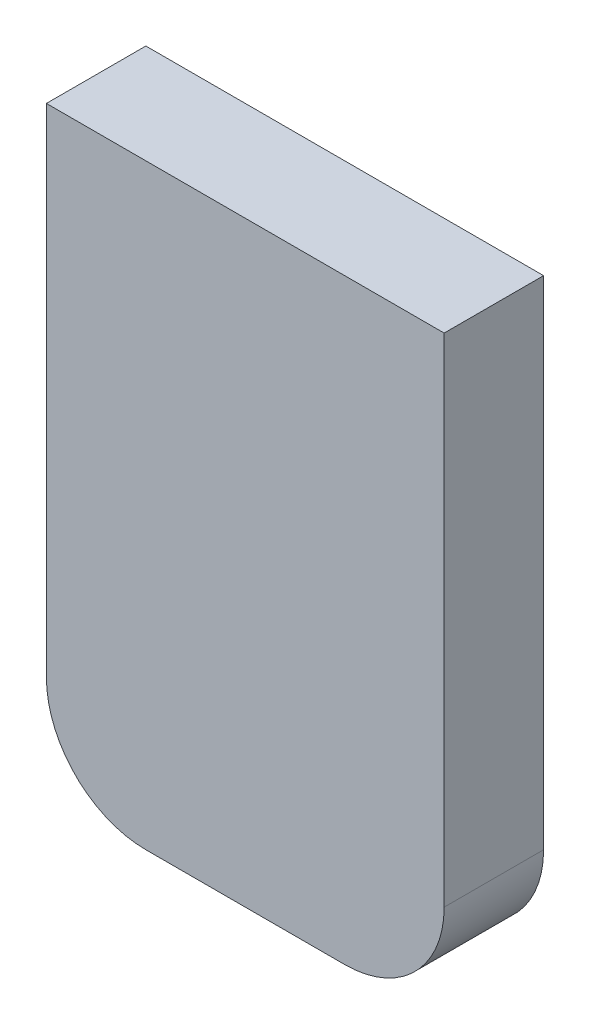
ISO-10303-21;
HEADER;
FILE_DESCRIPTION(('STEP AP214'),'2;1');
FILE_NAME('part.step','',(''),(''),'','','');
FILE_SCHEMA(('AUTOMOTIVE_DESIGN { 1 0 10303 214 1 1 1 1 }'));
ENDSEC;
DATA;
#1=APPLICATION_CONTEXT('core data for automotive mechanical design processes');
#2=APPLICATION_PROTOCOL_DEFINITION('international standard','automotive_design',2000,#1);
#3=PRODUCT_CONTEXT('',#1,'mechanical');
#4=PRODUCT('Part','Part','',(#3));
#5=PRODUCT_RELATED_PRODUCT_CATEGORY('part','',(#4));
#6=PRODUCT_DEFINITION_FORMATION('','',#4);
#7=PRODUCT_DEFINITION_CONTEXT('part definition',#1,'design');
#8=PRODUCT_DEFINITION('design','',#6,#7);
#9=PRODUCT_DEFINITION_SHAPE('','',#8);
#10=(LENGTH_UNIT() NAMED_UNIT(*) SI_UNIT(.MILLI.,.METRE.));
#11=(NAMED_UNIT(*) PLANE_ANGLE_UNIT() SI_UNIT($,.RADIAN.));
#12=(NAMED_UNIT(*) SI_UNIT($,.STERADIAN.) SOLID_ANGLE_UNIT());
#13=UNCERTAINTY_MEASURE_WITH_UNIT(LENGTH_MEASURE(1.E-05),#10,'distance_accuracy_value','');
#14=(GEOMETRIC_REPRESENTATION_CONTEXT(3) GLOBAL_UNCERTAINTY_ASSIGNED_CONTEXT((#13)) GLOBAL_UNIT_ASSIGNED_CONTEXT((#10,
#11,#12)) REPRESENTATION_CONTEXT('',''));
#15=CARTESIAN_POINT('',(0.,0.,0.));
#16=DIRECTION('',(0.,0.,1.));
#17=DIRECTION('',(1.,0.,0.));
#18=AXIS2_PLACEMENT_3D('',#15,#16,#17);
#19=CARTESIAN_POINT('',(-60.6067964513859,-55.8264462809917,0.));
#20=DIRECTION('',(0.,0.,-1.));
#21=DIRECTION('',(-1.,0.,0.));
#22=AXIS2_PLACEMENT_3D('',#19,#20,#21);
#23=CYLINDRICAL_SURFACE('',#22,7.);
#24=DIRECTION('',(0.,0.,-1.));
#25=VECTOR('',#24,1.);
#26=CARTESIAN_POINT('',(-63.8067964513859,-62.0521992475011,0.));
#27=LINE('',#26,#25);
#28=CARTESIAN_POINT('',(-63.8067964513859,-62.0521992475011,40.));
#29=VERTEX_POINT('',#28);
#30=CARTESIAN_POINT('',(-63.8067964513859,-62.0521992475011,47.));
#31=VERTEX_POINT('',#30);
#32=EDGE_CURVE('E48',#29,#31,#27,.F.);
#33=ORIENTED_EDGE('',*,*,#32,.F.);
#34=CARTESIAN_POINT('',(-60.6067964513859,-55.8264462809917,40.));
#35=DIRECTION('',(0.,0.,1.));
#36=DIRECTION('',(1.,0.,0.));
#37=AXIS2_PLACEMENT_3D('',#34,#35,#36);
#38=CIRCLE('',#37,7.);
#39=CARTESIAN_POINT('',(-67.6067964513859,-55.8264462809918,40.));
#40=VERTEX_POINT('',#39);
#41=EDGE_CURVE('E232',#29,#40,#38,.F.);
#42=ORIENTED_EDGE('',*,*,#41,.T.);
#43=DIRECTION('',(0.,0.,1.));
#44=VECTOR('',#43,1.);
#45=CARTESIAN_POINT('',(-67.6067964513859,-55.8264462809918,0.));
#46=LINE('',#45,#44);
#47=CARTESIAN_POINT('',(-67.6067964513859,-55.8264462809918,47.));
#48=VERTEX_POINT('',#47);
#49=EDGE_CURVE('E211',#40,#48,#46,.T.);
#50=ORIENTED_EDGE('',*,*,#49,.T.);
#51=CARTESIAN_POINT('',(-60.6067964513859,-55.8264462809917,47.));
#52=DIRECTION('',(0.,0.,1.));
#53=DIRECTION('',(1.,0.,0.));
#54=AXIS2_PLACEMENT_3D('',#51,#52,#53);
#55=CIRCLE('',#54,7.);
#56=EDGE_CURVE('E208',#48,#31,#55,.T.);
#57=ORIENTED_EDGE('',*,*,#56,.T.);
#58=EDGE_LOOP('',(#33,#42,#50,#57));
#59=FACE_BOUND('',#58,.T.);
#60=ADVANCED_FACE('F33',(#59),#23,.F.);
#61=CARTESIAN_POINT('',(-40.6067964513859,-55.8264462809917,50.));
#62=DIRECTION('',(0.,0.,-1.));
#63=DIRECTION('',(-1.,0.,0.));
#64=AXIS2_PLACEMENT_3D('',#61,#62,#63);
#65=CYLINDRICAL_SURFACE('',#64,7.);
#66=DIRECTION('',(0.,0.,-1.));
#67=VECTOR('',#66,1.);
#68=CARTESIAN_POINT('',(-37.4067964513859,-62.0521992475011,50.));
#69=LINE('',#68,#67);
#70=CARTESIAN_POINT('',(-37.4067964513859,-62.0521992475011,47.));
#71=VERTEX_POINT('',#70);
#72=CARTESIAN_POINT('',(-37.4067964513859,-62.0521992475011,40.));
#73=VERTEX_POINT('',#72);
#74=EDGE_CURVE('E169',#71,#73,#69,.T.);
#75=ORIENTED_EDGE('',*,*,#74,.F.);
#76=CARTESIAN_POINT('',(-40.6067964513859,-55.8264462809917,47.));
#77=DIRECTION('',(0.,0.,1.));
#78=DIRECTION('',(1.,0.,0.));
#79=AXIS2_PLACEMENT_3D('',#76,#77,#78);
#80=CIRCLE('',#79,7.);
#81=CARTESIAN_POINT('',(-33.6067964513859,-55.8264462809917,47.));
#82=VERTEX_POINT('',#81);
#83=EDGE_CURVE('E213',#71,#82,#80,.T.);
#84=ORIENTED_EDGE('',*,*,#83,.T.);
#85=DIRECTION('',(0.,0.,1.));
#86=VECTOR('',#85,1.);
#87=CARTESIAN_POINT('',(-33.6067964513859,-55.8264462809917,50.));
#88=LINE('',#87,#86);
#89=CARTESIAN_POINT('',(-33.6067964513859,-55.8264462809917,40.));
#90=VERTEX_POINT('',#89);
#91=EDGE_CURVE('E223',#82,#90,#88,.F.);
#92=ORIENTED_EDGE('',*,*,#91,.T.);
#93=CARTESIAN_POINT('',(-40.6067964513859,-55.8264462809917,40.));
#94=DIRECTION('',(0.,0.,1.));
#95=DIRECTION('',(1.,0.,0.));
#96=AXIS2_PLACEMENT_3D('',#93,#94,#95);
#97=CIRCLE('',#96,7.);
#98=EDGE_CURVE('E56',#90,#73,#97,.F.);
#99=ORIENTED_EDGE('',*,*,#98,.T.);
#100=EDGE_LOOP('',(#75,#84,#92,#99));
#101=FACE_BOUND('',#100,.T.);
#102=ADVANCED_FACE('F297',(#101),#65,.F.);
#103=CARTESIAN_POINT('',(-80.6067964513859,44.1735537190083,47.));
#104=DIRECTION('',(0.,0.,1.));
#105=DIRECTION('',(1.,0.,0.));
#106=AXIS2_PLACEMENT_3D('',#103,#104,#105);
#107=PLANE('',#106);
#108=DIRECTION('',(0.,1.,0.));
#109=VECTOR('',#108,1.);
#110=CARTESIAN_POINT('',(-63.8067964513859,-64.0264462809917,47.));
#111=LINE('',#110,#109);
#112=CARTESIAN_POINT('',(-63.8067964513859,-8.82644628099174,47.));
#113=VERTEX_POINT('',#112);
#114=EDGE_CURVE('E200',#31,#113,#111,.T.);
#115=ORIENTED_EDGE('',*,*,#114,.F.);
#116=ORIENTED_EDGE('',*,*,#56,.F.);
#117=DIRECTION('',(0.,-1.,0.));
#118=VECTOR('',#117,1.);
#119=CARTESIAN_POINT('',(-67.6067964513859,44.1735537190083,47.));
#120=LINE('',#119,#118);
#121=CARTESIAN_POINT('',(-67.6067964513859,-8.82644628099174,47.));
#122=VERTEX_POINT('',#121);
#123=EDGE_CURVE('E217',#122,#48,#120,.T.);
#124=ORIENTED_EDGE('',*,*,#123,.F.);
#125=DIRECTION('',(1.,0.,0.));
#126=VECTOR('',#125,1.);
#127=CARTESIAN_POINT('',(-80.6067964513859,-8.82644628099174,47.));
#128=LINE('',#127,#126);
#129=EDGE_CURVE('E214',#122,#113,#128,.T.);
#130=ORIENTED_EDGE('',*,*,#129,.T.);
#131=EDGE_LOOP('',(#115,#116,#124,#130));
#132=FACE_BOUND('',#131,.T.);
#133=ADVANCED_FACE('F303',(#132),#107,.F.);
#134=DIRECTION('',(0.,-1.,0.));
#135=VECTOR('',#134,1.);
#136=CARTESIAN_POINT('',(-37.4067964513859,-64.0264462809917,47.));
#137=LINE('',#136,#135);
#138=CARTESIAN_POINT('',(-37.4067964513859,-8.82644628099173,47.));
#139=VERTEX_POINT('',#138);
#140=EDGE_CURVE('E185',#139,#71,#137,.T.);
#141=ORIENTED_EDGE('',*,*,#140,.F.);
#142=CARTESIAN_POINT('',(-33.6067964513859,-8.82644628099173,47.));
#143=VERTEX_POINT('',#142);
#144=EDGE_CURVE('E218',#139,#143,#128,.T.);
#145=ORIENTED_EDGE('',*,*,#144,.T.);
#146=DIRECTION('',(0.,1.,0.));
#147=VECTOR('',#146,1.);
#148=CARTESIAN_POINT('',(-33.6067964513859,44.1735537190082,47.));
#149=LINE('',#148,#147);
#150=EDGE_CURVE('E224',#82,#143,#149,.T.);
#151=ORIENTED_EDGE('',*,*,#150,.F.);
#152=ORIENTED_EDGE('',*,*,#83,.F.);
#153=EDGE_LOOP('',(#141,#145,#151,#152));
#154=FACE_BOUND('',#153,.T.);
#155=ADVANCED_FACE('F300',(#154),#107,.F.);
#156=CARTESIAN_POINT('',(-104.606796451386,-8.82644628099174,40.));
#157=DIRECTION('',(0.,-1.,0.));
#158=DIRECTION('',(1.,0.,0.));
#159=AXIS2_PLACEMENT_3D('',#156,#157,#158);
#160=PLANE('',#159);
#161=DIRECTION('',(1.,0.,0.));
#162=VECTOR('',#161,1.);
#163=CARTESIAN_POINT('',(-104.606796451386,-8.82644628099175,40.));
#164=LINE('',#163,#162);
#165=CARTESIAN_POINT('',(-67.6067964513859,-8.82644628099174,40.));
#166=VERTEX_POINT('',#165);
#167=CARTESIAN_POINT('',(-63.8067964513859,-8.82644628099174,40.));
#168=VERTEX_POINT('',#167);
#169=EDGE_CURVE('E236',#166,#168,#164,.T.);
#170=ORIENTED_EDGE('',*,*,#169,.T.);
#171=DIRECTION('',(0.,0.,1.));
#172=VECTOR('',#171,1.);
#173=CARTESIAN_POINT('',(-63.8067964513859,-8.82644628099174,40.));
#174=LINE('',#173,#172);
#175=EDGE_CURVE('E11',#168,#113,#174,.T.);
#176=ORIENTED_EDGE('',*,*,#175,.T.);
#177=ORIENTED_EDGE('',*,*,#129,.F.);
#178=DIRECTION('',(0.,0.,1.));
#179=VECTOR('',#178,1.);
#180=CARTESIAN_POINT('',(-67.6067964513859,-8.82644628099173,0.));
#181=LINE('',#180,#179);
#182=EDGE_CURVE('E221',#166,#122,#181,.T.);
#183=ORIENTED_EDGE('',*,*,#182,.F.);
#184=EDGE_LOOP('',(#170,#176,#177,#183));
#185=FACE_BOUND('',#184,.T.);
#186=ADVANCED_FACE('F302',(#185),#160,.T.);
#187=ORIENTED_EDGE('',*,*,#144,.F.);
#188=DIRECTION('',(0.,0.,-1.));
#189=VECTOR('',#188,1.);
#190=CARTESIAN_POINT('',(-37.4067964513859,-8.82644628099173,40.));
#191=LINE('',#190,#189);
#192=CARTESIAN_POINT('',(-37.4067964513859,-8.82644628099173,40.));
#193=VERTEX_POINT('',#192);
#194=EDGE_CURVE('E41',#139,#193,#191,.T.);
#195=ORIENTED_EDGE('',*,*,#194,.T.);
#196=CARTESIAN_POINT('',(-33.6067964513859,-8.82644628099173,40.));
#197=VERTEX_POINT('',#196);
#198=EDGE_CURVE('E238',#193,#197,#164,.T.);
#199=ORIENTED_EDGE('',*,*,#198,.T.);
#200=DIRECTION('',(0.,0.,-1.));
#201=VECTOR('',#200,1.);
#202=CARTESIAN_POINT('',(-33.6067964513859,-8.82644628099173,40.));
#203=LINE('',#202,#201);
#204=EDGE_CURVE('E207',#143,#197,#203,.T.);
#205=ORIENTED_EDGE('',*,*,#204,.F.);
#206=EDGE_LOOP('',(#187,#195,#199,#205));
#207=FACE_BOUND('',#206,.T.);
#208=ADVANCED_FACE('F286',(#207),#160,.T.);
#209=CARTESIAN_POINT('',(-60.6067964513859,-55.8264462809917,0.));
#210=DIRECTION('',(0.,0.,-1.));
#211=DIRECTION('',(-1.,0.,0.));
#212=AXIS2_PLACEMENT_3D('',#209,#210,#211);
#213=CYLINDRICAL_SURFACE('',#212,10.);
#214=CARTESIAN_POINT('',(-60.6067964513859,-55.8264462809917,40.));
#215=DIRECTION('',(0.,0.,1.));
#216=DIRECTION('',(1.,0.,0.));
#217=AXIS2_PLACEMENT_3D('',#214,#215,#216);
#218=CIRCLE('',#217,10.);
#219=CARTESIAN_POINT('',(-60.6067964513859,-65.8264462809917,40.));
#220=VERTEX_POINT('',#219);
#221=CARTESIAN_POINT('',(-70.6067964513859,-55.8264462809918,40.));
#222=VERTEX_POINT('',#221);
#223=EDGE_CURVE('E249',#220,#222,#218,.F.);
#224=ORIENTED_EDGE('',*,*,#223,.F.);
#225=DIRECTION('',(0.,0.,1.));
#226=VECTOR('',#225,1.);
#227=CARTESIAN_POINT('',(-60.6067964513859,-65.8264462809917,0.));
#228=LINE('',#227,#226);
#229=CARTESIAN_POINT('',(-60.6067964513859,-65.8264462809917,50.));
#230=VERTEX_POINT('',#229);
#231=EDGE_CURVE('E275',#230,#220,#228,.F.);
#232=ORIENTED_EDGE('',*,*,#231,.F.);
#233=CARTESIAN_POINT('',(-60.6067964513859,-55.8264462809917,50.));
#234=DIRECTION('',(0.,0.,1.));
#235=DIRECTION('',(1.,0.,0.));
#236=AXIS2_PLACEMENT_3D('',#233,#234,#235);
#237=CIRCLE('',#236,10.);
#238=CARTESIAN_POINT('',(-70.6067964513859,-55.8264462809918,50.));
#239=VERTEX_POINT('',#238);
#240=EDGE_CURVE('E278',#239,#230,#237,.T.);
#241=ORIENTED_EDGE('',*,*,#240,.F.);
#242=DIRECTION('',(0.,0.,1.));
#243=VECTOR('',#242,1.);
#244=CARTESIAN_POINT('',(-70.6067964513859,-55.8264462809917,0.));
#245=LINE('',#244,#243);
#246=EDGE_CURVE('E273',#222,#239,#245,.T.);
#247=ORIENTED_EDGE('',*,*,#246,.F.);
#248=EDGE_LOOP('',(#224,#232,#241,#247));
#249=FACE_BOUND('',#248,.T.);
#250=ADVANCED_FACE('F35',(#249),#213,.T.);
#251=CARTESIAN_POINT('',(-40.6067964513859,-55.8264462809917,50.));
#252=DIRECTION('',(0.,0.,-1.));
#253=DIRECTION('',(-1.,0.,0.));
#254=AXIS2_PLACEMENT_3D('',#251,#252,#253);
#255=CYLINDRICAL_SURFACE('',#254,10.);
#256=CARTESIAN_POINT('',(-40.6067964513859,-55.8264462809917,40.));
#257=DIRECTION('',(0.,0.,1.));
#258=DIRECTION('',(1.,0.,0.));
#259=AXIS2_PLACEMENT_3D('',#256,#257,#258);
#260=CIRCLE('',#259,10.);
#261=CARTESIAN_POINT('',(-30.6067964513859,-55.8264462809917,40.));
#262=VERTEX_POINT('',#261);
#263=CARTESIAN_POINT('',(-40.6067964513859,-65.8264462809917,40.));
#264=VERTEX_POINT('',#263);
#265=EDGE_CURVE('E247',#262,#264,#260,.F.);
#266=ORIENTED_EDGE('',*,*,#265,.F.);
#267=DIRECTION('',(0.,0.,-1.));
#268=VECTOR('',#267,1.);
#269=CARTESIAN_POINT('',(-30.6067964513859,-55.8264462809917,50.));
#270=LINE('',#269,#268);
#271=CARTESIAN_POINT('',(-30.6067964513859,-55.8264462809917,50.));
#272=VERTEX_POINT('',#271);
#273=EDGE_CURVE('E266',#272,#262,#270,.T.);
#274=ORIENTED_EDGE('',*,*,#273,.F.);
#275=CARTESIAN_POINT('',(-40.6067964513859,-55.8264462809917,50.));
#276=DIRECTION('',(0.,0.,1.));
#277=DIRECTION('',(1.,0.,0.));
#278=AXIS2_PLACEMENT_3D('',#275,#276,#277);
#279=CIRCLE('',#278,10.);
#280=CARTESIAN_POINT('',(-40.6067964513859,-65.8264462809917,50.));
#281=VERTEX_POINT('',#280);
#282=EDGE_CURVE('E271',#281,#272,#279,.T.);
#283=ORIENTED_EDGE('',*,*,#282,.F.);
#284=DIRECTION('',(0.,0.,-1.));
#285=VECTOR('',#284,1.);
#286=CARTESIAN_POINT('',(-40.6067964513859,-65.8264462809917,0.));
#287=LINE('',#286,#285);
#288=EDGE_CURVE('E269',#264,#281,#287,.F.);
#289=ORIENTED_EDGE('',*,*,#288,.F.);
#290=EDGE_LOOP('',(#266,#274,#283,#289));
#291=FACE_BOUND('',#290,.T.);
#292=ADVANCED_FACE('F357',(#291),#255,.T.);
#293=CARTESIAN_POINT('',(-30.6067964513859,44.1735537190082,50.));
#294=DIRECTION('',(-1.,0.,0.));
#295=DIRECTION('',(0.,-1.,0.));
#296=AXIS2_PLACEMENT_3D('',#293,#294,#295);
#297=PLANE('',#296);
#298=ORIENTED_EDGE('',*,*,#273,.T.);
#299=DIRECTION('',(0.,-1.,0.));
#300=VECTOR('',#299,1.);
#301=CARTESIAN_POINT('',(-30.6067964513859,-65.8264462809917,40.));
#302=LINE('',#301,#300);
#303=CARTESIAN_POINT('',(-30.6067964513859,-5.82644628099173,40.));
#304=VERTEX_POINT('',#303);
#305=EDGE_CURVE('E242',#304,#262,#302,.T.);
#306=ORIENTED_EDGE('',*,*,#305,.F.);
#307=DIRECTION('',(0.,0.,-1.));
#308=VECTOR('',#307,1.);
#309=CARTESIAN_POINT('',(-30.6067964513859,-5.82644628099173,40.));
#310=LINE('',#309,#308);
#311=CARTESIAN_POINT('',(-30.6067964513859,-5.82644628099173,50.));
#312=VERTEX_POINT('',#311);
#313=EDGE_CURVE('E210',#312,#304,#310,.T.);
#314=ORIENTED_EDGE('',*,*,#313,.F.);
#315=DIRECTION('',(0.,1.,0.));
#316=VECTOR('',#315,1.);
#317=CARTESIAN_POINT('',(-30.6067964513859,44.1735537190082,50.));
#318=LINE('',#317,#316);
#319=EDGE_CURVE('E263',#272,#312,#318,.T.);
#320=ORIENTED_EDGE('',*,*,#319,.F.);
#321=EDGE_LOOP('',(#298,#306,#314,#320));
#322=FACE_BOUND('',#321,.T.);
#323=ADVANCED_FACE('F354',(#322),#297,.F.);
#324=CARTESIAN_POINT('',(-80.6067964513859,44.1735537190083,50.));
#325=DIRECTION('',(0.,0.,1.));
#326=DIRECTION('',(1.,0.,0.));
#327=AXIS2_PLACEMENT_3D('',#324,#325,#326);
#328=PLANE('',#327);
#329=DIRECTION('',(1.,0.,0.));
#330=VECTOR('',#329,1.);
#331=CARTESIAN_POINT('',(-80.6067964513859,-5.82644628099174,50.));
#332=LINE('',#331,#330);
#333=CARTESIAN_POINT('',(-70.6067964513859,-5.82644628099174,50.));
#334=VERTEX_POINT('',#333);
#335=EDGE_CURVE('E253',#334,#312,#332,.T.);
#336=ORIENTED_EDGE('',*,*,#335,.F.);
#337=DIRECTION('',(0.,-1.,0.));
#338=VECTOR('',#337,1.);
#339=CARTESIAN_POINT('',(-70.6067964513859,25.1735537190083,50.));
#340=LINE('',#339,#338);
#341=EDGE_CURVE('E258',#334,#239,#340,.T.);
#342=ORIENTED_EDGE('',*,*,#341,.T.);
#343=ORIENTED_EDGE('',*,*,#240,.T.);
#344=DIRECTION('',(-1.,0.,0.));
#345=VECTOR('',#344,1.);
#346=CARTESIAN_POINT('',(-70.6067964513859,-65.8264462809917,50.));
#347=LINE('',#346,#345);
#348=EDGE_CURVE('E255',#281,#230,#347,.T.);
#349=ORIENTED_EDGE('',*,*,#348,.F.);
#350=ORIENTED_EDGE('',*,*,#282,.T.);
#351=ORIENTED_EDGE('',*,*,#319,.T.);
#352=EDGE_LOOP('',(#336,#342,#343,#349,#350,#351));
#353=FACE_BOUND('',#352,.T.);
#354=ADVANCED_FACE('F350',(#353),#328,.T.);
#355=CARTESIAN_POINT('',(-70.6067964513859,25.1735537190083,0.));
#356=DIRECTION('',(-1.,0.,0.));
#357=DIRECTION('',(0.,0.,1.));
#358=AXIS2_PLACEMENT_3D('',#355,#356,#357);
#359=PLANE('',#358);
#360=DIRECTION('',(0.,1.,0.));
#361=VECTOR('',#360,1.);
#362=CARTESIAN_POINT('',(-70.6067964513859,25.1735537190083,40.));
#363=LINE('',#362,#361);
#364=CARTESIAN_POINT('',(-70.6067964513859,-5.82644628099174,40.));
#365=VERTEX_POINT('',#364);
#366=EDGE_CURVE('E251',#222,#365,#363,.T.);
#367=ORIENTED_EDGE('',*,*,#366,.F.);
#368=ORIENTED_EDGE('',*,*,#246,.T.);
#369=ORIENTED_EDGE('',*,*,#341,.F.);
#370=DIRECTION('',(0.,0.,1.));
#371=VECTOR('',#370,1.);
#372=CARTESIAN_POINT('',(-70.6067964513859,-5.82644628099174,50.));
#373=LINE('',#372,#371);
#374=EDGE_CURVE('E261',#365,#334,#373,.T.);
#375=ORIENTED_EDGE('',*,*,#374,.F.);
#376=EDGE_LOOP('',(#367,#368,#369,#375));
#377=FACE_BOUND('',#376,.T.);
#378=ADVANCED_FACE('F346',(#377),#359,.T.);
#379=CARTESIAN_POINT('',(0.,-65.8264462809917,0.));
#380=DIRECTION('',(0.,1.,0.));
#381=DIRECTION('',(0.,0.,1.));
#382=AXIS2_PLACEMENT_3D('',#379,#380,#381);
#383=PLANE('',#382);
#384=ORIENTED_EDGE('',*,*,#231,.T.);
#385=DIRECTION('',(1.,0.,0.));
#386=VECTOR('',#385,1.);
#387=CARTESIAN_POINT('',(0.,-65.8264462809917,40.));
#388=LINE('',#387,#386);
#389=EDGE_CURVE('E280',#220,#264,#388,.T.);
#390=ORIENTED_EDGE('',*,*,#389,.T.);
#391=ORIENTED_EDGE('',*,*,#288,.T.);
#392=ORIENTED_EDGE('',*,*,#348,.T.);
#393=EDGE_LOOP('',(#384,#390,#391,#392));
#394=FACE_BOUND('',#393,.T.);
#395=ADVANCED_FACE('F340',(#394),#383,.F.);
#396=CARTESIAN_POINT('',(-104.606796451386,-65.8264462809917,40.));
#397=DIRECTION('',(0.,0.,1.));
#398=DIRECTION('',(1.,0.,0.));
#399=AXIS2_PLACEMENT_3D('',#396,#397,#398);
#400=PLANE('',#399);
#401=ORIENTED_EDGE('',*,*,#41,.F.);
#402=DIRECTION('',(0.,-1.,0.));
#403=VECTOR('',#402,1.);
#404=CARTESIAN_POINT('',(-63.8067964513859,-64.0264462809917,40.));
#405=LINE('',#404,#403);
#406=EDGE_CURVE('E197',#168,#29,#405,.T.);
#407=ORIENTED_EDGE('',*,*,#406,.F.);
#408=ORIENTED_EDGE('',*,*,#169,.F.);
#409=DIRECTION('',(0.,1.,0.));
#410=VECTOR('',#409,1.);
#411=CARTESIAN_POINT('',(-67.6067964513859,25.1735537190083,40.));
#412=LINE('',#411,#410);
#413=EDGE_CURVE('E234',#40,#166,#412,.T.);
#414=ORIENTED_EDGE('',*,*,#413,.F.);
#415=EDGE_LOOP('',(#401,#407,#408,#414));
#416=FACE_BOUND('',#415,.T.);
#417=ORIENTED_EDGE('',*,*,#198,.F.);
#418=DIRECTION('',(0.,1.,0.));
#419=VECTOR('',#418,1.);
#420=CARTESIAN_POINT('',(-37.4067964513859,-64.0264462809917,40.));
#421=LINE('',#420,#419);
#422=EDGE_CURVE('E190',#73,#193,#421,.T.);
#423=ORIENTED_EDGE('',*,*,#422,.F.);
#424=ORIENTED_EDGE('',*,*,#98,.F.);
#425=DIRECTION('',(0.,-1.,0.));
#426=VECTOR('',#425,1.);
#427=CARTESIAN_POINT('',(-33.6067964513859,-65.8264462809917,40.));
#428=LINE('',#427,#426);
#429=EDGE_CURVE('E230',#197,#90,#428,.T.);
#430=ORIENTED_EDGE('',*,*,#429,.F.);
#431=EDGE_LOOP('',(#417,#423,#424,#430));
#432=FACE_BOUND('',#431,.T.);
#433=DIRECTION('',(0.,-1.,0.));
#434=VECTOR('',#433,1.);
#435=CARTESIAN_POINT('',(-60.8067964513859,-61.0264462809917,40.));
#436=LINE('',#435,#434);
#437=CARTESIAN_POINT('',(-60.8067964513859,-11.0264462809917,40.));
#438=VERTEX_POINT('',#437);
#439=CARTESIAN_POINT('',(-60.8067964513859,-61.0264462809917,40.));
#440=VERTEX_POINT('',#439);
#441=EDGE_CURVE('E162',#438,#440,#436,.T.);
#442=ORIENTED_EDGE('',*,*,#441,.T.);
#443=DIRECTION('',(1.,0.,0.));
#444=VECTOR('',#443,1.);
#445=CARTESIAN_POINT('',(-40.4067964513859,-61.0264462809917,40.));
#446=LINE('',#445,#444);
#447=CARTESIAN_POINT('',(-40.4067964513859,-61.0264462809917,40.));
#448=VERTEX_POINT('',#447);
#449=EDGE_CURVE('E178',#440,#448,#446,.T.);
#450=ORIENTED_EDGE('',*,*,#449,.T.);
#451=DIRECTION('',(0.,1.,0.));
#452=VECTOR('',#451,1.);
#453=CARTESIAN_POINT('',(-40.4067964513859,-61.0264462809917,40.));
#454=LINE('',#453,#452);
#455=CARTESIAN_POINT('',(-40.4067964513859,-11.0264462809917,40.));
#456=VERTEX_POINT('',#455);
#457=EDGE_CURVE('E165',#448,#456,#454,.T.);
#458=ORIENTED_EDGE('',*,*,#457,.T.);
#459=DIRECTION('',(-1.,0.,0.));
#460=VECTOR('',#459,1.);
#461=CARTESIAN_POINT('',(-40.4067964513859,-11.0264462809917,40.));
#462=LINE('',#461,#460);
#463=EDGE_CURVE('E158',#456,#438,#462,.T.);
#464=ORIENTED_EDGE('',*,*,#463,.T.);
#465=EDGE_LOOP('',(#442,#450,#458,#464));
#466=FACE_BOUND('',#465,.T.);
#467=ORIENTED_EDGE('',*,*,#366,.T.);
#468=DIRECTION('',(1.,0.,0.));
#469=VECTOR('',#468,1.);
#470=CARTESIAN_POINT('',(-104.606796451386,-5.82644628099174,40.));
#471=LINE('',#470,#469);
#472=EDGE_CURVE('E244',#365,#304,#471,.T.);
#473=ORIENTED_EDGE('',*,*,#472,.T.);
#474=ORIENTED_EDGE('',*,*,#305,.T.);
#475=ORIENTED_EDGE('',*,*,#265,.T.);
#476=ORIENTED_EDGE('',*,*,#389,.F.);
#477=ORIENTED_EDGE('',*,*,#223,.T.);
#478=EDGE_LOOP('',(#467,#473,#474,#475,#476,#477));
#479=FACE_BOUND('',#478,.T.);
#480=ADVANCED_FACE('F160',(#416,#432,#466,#479),#400,.F.);
#481=CARTESIAN_POINT('',(-104.606796451386,-5.82644628099174,40.));
#482=DIRECTION('',(0.,-1.,0.));
#483=DIRECTION('',(1.,0.,0.));
#484=AXIS2_PLACEMENT_3D('',#481,#482,#483);
#485=PLANE('',#484);
#486=ORIENTED_EDGE('',*,*,#335,.T.);
#487=ORIENTED_EDGE('',*,*,#313,.T.);
#488=ORIENTED_EDGE('',*,*,#472,.F.);
#489=ORIENTED_EDGE('',*,*,#374,.T.);
#490=EDGE_LOOP('',(#486,#487,#488,#489));
#491=FACE_BOUND('',#490,.T.);
#492=ADVANCED_FACE('F328',(#491),#485,.F.);
#493=CARTESIAN_POINT('',(-33.6067964513859,44.1735537190082,50.));
#494=DIRECTION('',(-1.,0.,0.));
#495=DIRECTION('',(0.,-1.,0.));
#496=AXIS2_PLACEMENT_3D('',#493,#494,#495);
#497=PLANE('',#496);
#498=ORIENTED_EDGE('',*,*,#91,.F.);
#499=ORIENTED_EDGE('',*,*,#150,.T.);
#500=ORIENTED_EDGE('',*,*,#204,.T.);
#501=ORIENTED_EDGE('',*,*,#429,.T.);
#502=EDGE_LOOP('',(#498,#499,#500,#501));
#503=FACE_BOUND('',#502,.T.);
#504=ADVANCED_FACE('F295',(#503),#497,.T.);
#505=CARTESIAN_POINT('',(-67.6067964513859,25.1735537190083,0.));
#506=DIRECTION('',(-1.,0.,0.));
#507=DIRECTION('',(0.,0.,1.));
#508=AXIS2_PLACEMENT_3D('',#505,#506,#507);
#509=PLANE('',#508);
#510=ORIENTED_EDGE('',*,*,#413,.T.);
#511=ORIENTED_EDGE('',*,*,#182,.T.);
#512=ORIENTED_EDGE('',*,*,#123,.T.);
#513=ORIENTED_EDGE('',*,*,#49,.F.);
#514=EDGE_LOOP('',(#510,#511,#512,#513));
#515=FACE_BOUND('',#514,.T.);
#516=ADVANCED_FACE('F327',(#515),#509,.F.);
#517=CARTESIAN_POINT('',(-63.8067964513859,-64.0264462809917,-21.9109037246267));
#518=DIRECTION('',(1.,0.,0.));
#519=DIRECTION('',(0.,0.,-1.));
#520=AXIS2_PLACEMENT_3D('',#517,#518,#519);
#521=PLANE('',#520);
#522=ORIENTED_EDGE('',*,*,#406,.T.);
#523=ORIENTED_EDGE('',*,*,#32,.T.);
#524=ORIENTED_EDGE('',*,*,#114,.T.);
#525=ORIENTED_EDGE('',*,*,#175,.F.);
#526=EDGE_LOOP('',(#522,#523,#524,#525));
#527=FACE_BOUND('',#526,.T.);
#528=ADVANCED_FACE('F333',(#527),#521,.F.);
#529=CARTESIAN_POINT('',(-37.4067964513859,-64.0264462809917,-21.9109037246267));
#530=DIRECTION('',(-1.,0.,0.));
#531=DIRECTION('',(0.,0.,1.));
#532=AXIS2_PLACEMENT_3D('',#529,#530,#531);
#533=PLANE('',#532);
#534=ORIENTED_EDGE('',*,*,#140,.T.);
#535=ORIENTED_EDGE('',*,*,#74,.T.);
#536=ORIENTED_EDGE('',*,*,#422,.T.);
#537=ORIENTED_EDGE('',*,*,#194,.F.);
#538=EDGE_LOOP('',(#534,#535,#536,#537));
#539=FACE_BOUND('',#538,.T.);
#540=ADVANCED_FACE('F290',(#539),#533,.F.);
#541=CARTESIAN_POINT('',(-60.8067964513859,-61.0264462809917,-21.9109037246267));
#542=DIRECTION('',(1.,0.,0.));
#543=DIRECTION('',(0.,0.,-1.));
#544=AXIS2_PLACEMENT_3D('',#541,#542,#543);
#545=PLANE('',#544);
#546=ORIENTED_EDGE('',*,*,#441,.F.);
#547=DIRECTION('',(0.,0.,1.));
#548=VECTOR('',#547,1.);
#549=CARTESIAN_POINT('',(-60.8067964513859,-11.0264462809917,-21.9109037246267));
#550=LINE('',#549,#548);
#551=CARTESIAN_POINT('',(-60.8067964513859,-11.0264462809917,47.));
#552=VERTEX_POINT('',#551);
#553=EDGE_CURVE('E173',#438,#552,#550,.T.);
#554=ORIENTED_EDGE('',*,*,#553,.T.);
#555=DIRECTION('',(0.,1.,0.));
#556=VECTOR('',#555,1.);
#557=CARTESIAN_POINT('',(-60.8067964513859,-61.0264462809917,47.));
#558=LINE('',#557,#556);
#559=CARTESIAN_POINT('',(-60.8067964513859,-61.0264462809917,47.));
#560=VERTEX_POINT('',#559);
#561=EDGE_CURVE('E548',#560,#552,#558,.T.);
#562=ORIENTED_EDGE('',*,*,#561,.F.);
#563=DIRECTION('',(0.,0.,1.));
#564=VECTOR('',#563,1.);
#565=CARTESIAN_POINT('',(-60.8067964513859,-61.0264462809917,-21.9109037246267));
#566=LINE('',#565,#564);
#567=EDGE_CURVE('E176',#440,#560,#566,.T.);
#568=ORIENTED_EDGE('',*,*,#567,.F.);
#569=EDGE_LOOP('',(#546,#554,#562,#568));
#570=FACE_BOUND('',#569,.T.);
#571=ADVANCED_FACE('F172',(#570),#545,.T.);
#572=CARTESIAN_POINT('',(-40.4067964513859,-11.0264462809917,-21.9109037246267));
#573=DIRECTION('',(0.,-1.,0.));
#574=DIRECTION('',(0.,0.,-1.));
#575=AXIS2_PLACEMENT_3D('',#572,#573,#574);
#576=PLANE('',#575);
#577=ORIENTED_EDGE('',*,*,#463,.F.);
#578=DIRECTION('',(0.,0.,1.));
#579=VECTOR('',#578,1.);
#580=CARTESIAN_POINT('',(-40.4067964513859,-11.0264462809917,-21.9109037246267));
#581=LINE('',#580,#579);
#582=CARTESIAN_POINT('',(-40.4067964513859,-11.0264462809917,47.));
#583=VERTEX_POINT('',#582);
#584=EDGE_CURVE('E184',#456,#583,#581,.T.);
#585=ORIENTED_EDGE('',*,*,#584,.T.);
#586=DIRECTION('',(1.,0.,0.));
#587=VECTOR('',#586,1.);
#588=CARTESIAN_POINT('',(-40.4067964513859,-11.0264462809917,47.));
#589=LINE('',#588,#587);
#590=EDGE_CURVE('E182',#552,#583,#589,.T.);
#591=ORIENTED_EDGE('',*,*,#590,.F.);
#592=ORIENTED_EDGE('',*,*,#553,.F.);
#593=EDGE_LOOP('',(#577,#585,#591,#592));
#594=FACE_BOUND('',#593,.T.);
#595=ADVANCED_FACE('F180',(#594),#576,.T.);
#596=CARTESIAN_POINT('',(-40.4067964513859,-61.0264462809917,-21.9109037246267));
#597=DIRECTION('',(-1.,0.,0.));
#598=DIRECTION('',(0.,0.,1.));
#599=AXIS2_PLACEMENT_3D('',#596,#597,#598);
#600=PLANE('',#599);
#601=ORIENTED_EDGE('',*,*,#457,.F.);
#602=DIRECTION('',(0.,0.,1.));
#603=VECTOR('',#602,1.);
#604=CARTESIAN_POINT('',(-40.4067964513859,-61.0264462809917,-21.9109037246267));
#605=LINE('',#604,#603);
#606=CARTESIAN_POINT('',(-40.4067964513859,-61.0264462809917,47.));
#607=VERTEX_POINT('',#606);
#608=EDGE_CURVE('E187',#448,#607,#605,.T.);
#609=ORIENTED_EDGE('',*,*,#608,.T.);
#610=DIRECTION('',(0.,-1.,0.));
#611=VECTOR('',#610,1.);
#612=CARTESIAN_POINT('',(-40.4067964513859,-61.0264462809917,47.));
#613=LINE('',#612,#611);
#614=EDGE_CURVE('E546',#583,#607,#613,.T.);
#615=ORIENTED_EDGE('',*,*,#614,.F.);
#616=ORIENTED_EDGE('',*,*,#584,.F.);
#617=EDGE_LOOP('',(#601,#609,#615,#616));
#618=FACE_BOUND('',#617,.T.);
#619=ADVANCED_FACE('F511',(#618),#600,.T.);
#620=CARTESIAN_POINT('',(-40.4067964513859,-61.0264462809917,-21.9109037246267));
#621=DIRECTION('',(0.,1.,0.));
#622=DIRECTION('',(0.,0.,1.));
#623=AXIS2_PLACEMENT_3D('',#620,#621,#622);
#624=PLANE('',#623);
#625=ORIENTED_EDGE('',*,*,#449,.F.);
#626=ORIENTED_EDGE('',*,*,#567,.T.);
#627=DIRECTION('',(-1.,0.,0.));
#628=VECTOR('',#627,1.);
#629=CARTESIAN_POINT('',(-40.4067964513859,-61.0264462809917,47.));
#630=LINE('',#629,#628);
#631=EDGE_CURVE('E201',#607,#560,#630,.T.);
#632=ORIENTED_EDGE('',*,*,#631,.F.);
#633=ORIENTED_EDGE('',*,*,#608,.F.);
#634=EDGE_LOOP('',(#625,#626,#632,#633));
#635=FACE_BOUND('',#634,.T.);
#636=ADVANCED_FACE('F316',(#635),#624,.T.);
#637=ORIENTED_EDGE('',*,*,#631,.T.);
#638=ORIENTED_EDGE('',*,*,#561,.T.);
#639=ORIENTED_EDGE('',*,*,#590,.T.);
#640=ORIENTED_EDGE('',*,*,#614,.T.);
#641=EDGE_LOOP('',(#637,#638,#639,#640));
#642=FACE_BOUND('',#641,.T.);
#643=ADVANCED_FACE('F305',(#642),#107,.F.);
#644=CLOSED_SHELL('',(#60,#102,#133,#155,#186,#208,#250,#292,#323,#354,#378,#395,#480,#492,#504,
#516,#528,#540,#571,#595,#619,#636,#643));
#645=MANIFOLD_SOLID_BREP('B2',#644);
#646=ADVANCED_BREP_SHAPE_REPRESENTATION('',(#18,#645),#14);
#647=SHAPE_DEFINITION_REPRESENTATION(#9,#646);
ENDSEC;
END-ISO-10303-21;
